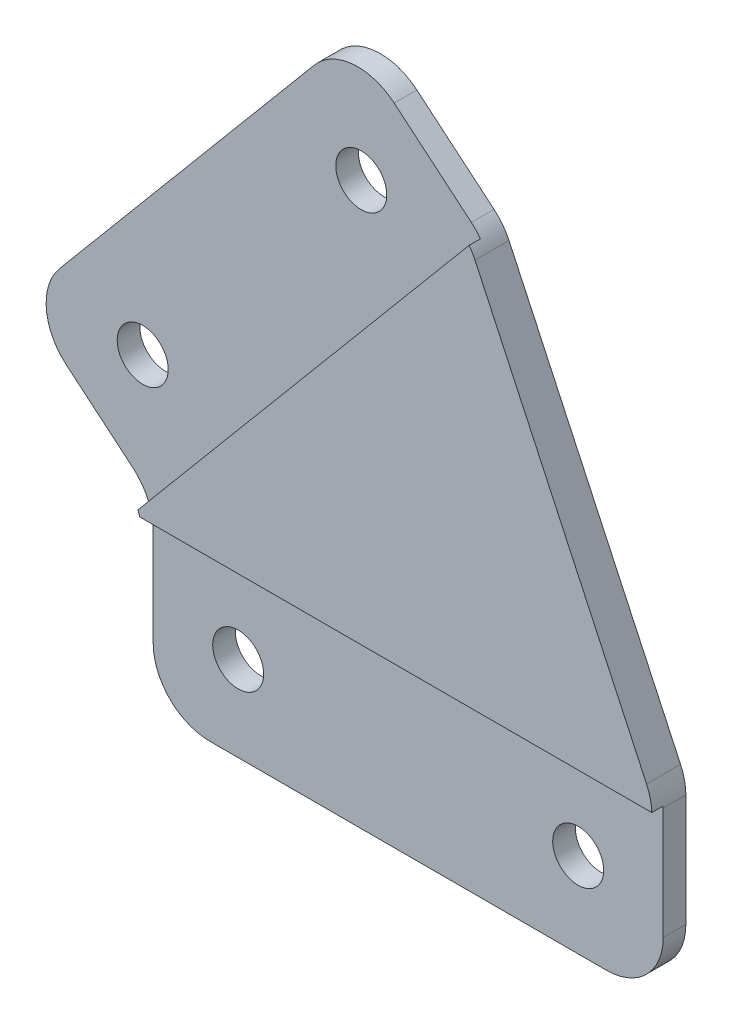
ISO-10303-21;
HEADER;
FILE_DESCRIPTION(('STEP AP214'),'2;1');
FILE_NAME('part.step','',(''),(''),'','','');
FILE_SCHEMA(('AUTOMOTIVE_DESIGN { 1 0 10303 214 1 1 1 1 }'));
ENDSEC;
DATA;
#1=APPLICATION_CONTEXT('core data for automotive mechanical design processes');
#2=APPLICATION_PROTOCOL_DEFINITION('international standard','automotive_design',2000,#1);
#3=PRODUCT_CONTEXT('',#1,'mechanical');
#4=PRODUCT('Part','Part','',(#3));
#5=PRODUCT_RELATED_PRODUCT_CATEGORY('part','',(#4));
#6=PRODUCT_DEFINITION_FORMATION('','',#4);
#7=PRODUCT_DEFINITION_CONTEXT('part definition',#1,'design');
#8=PRODUCT_DEFINITION('design','',#6,#7);
#9=PRODUCT_DEFINITION_SHAPE('','',#8);
#10=(LENGTH_UNIT() NAMED_UNIT(*) SI_UNIT(.MILLI.,.METRE.));
#11=(NAMED_UNIT(*) PLANE_ANGLE_UNIT() SI_UNIT($,.RADIAN.));
#12=(NAMED_UNIT(*) SI_UNIT($,.STERADIAN.) SOLID_ANGLE_UNIT());
#13=UNCERTAINTY_MEASURE_WITH_UNIT(LENGTH_MEASURE(1.E-05),#10,'distance_accuracy_value','');
#14=(GEOMETRIC_REPRESENTATION_CONTEXT(3) GLOBAL_UNCERTAINTY_ASSIGNED_CONTEXT((#13)) GLOBAL_UNIT_ASSIGNED_CONTEXT((#10,
#11,#12)) REPRESENTATION_CONTEXT('',''));
#15=CARTESIAN_POINT('',(0.,0.,0.));
#16=DIRECTION('',(0.,0.,1.));
#17=DIRECTION('',(1.,0.,0.));
#18=AXIS2_PLACEMENT_3D('',#15,#16,#17);
#19=CARTESIAN_POINT('',(-11.4906666467846,9.64181414529815,3.));
#20=DIRECTION('',(0.766044443118975,-0.642787609686543,0.));
#21=DIRECTION('',(0.642787609686543,0.766044443118975,0.));
#22=AXIS2_PLACEMENT_3D('',#19,#20,#21);
#23=PLANE('',#22);
#24=DIRECTION('',(0.,0.,-1.));
#25=VECTOR('',#24,1.);
#26=CARTESIAN_POINT('',(-8.27672859835191,13.472036360893,3.));
#27=LINE('',#26,#25);
#28=CARTESIAN_POINT('',(-8.27672859835191,13.472036360893,0.));
#29=VERTEX_POINT('',#28);
#30=CARTESIAN_POINT('',(-8.27672859835191,13.472036360893,2.));
#31=VERTEX_POINT('',#30);
#32=EDGE_CURVE('E193',#29,#31,#27,.F.);
#33=ORIENTED_EDGE('',*,*,#32,.T.);
#34=DIRECTION('',(-0.642787609686543,-0.766044443118975,0.));
#35=VECTOR('',#34,1.);
#36=CARTESIAN_POINT('',(17.4347757891098,44.113814085652,2.));
#37=LINE('',#36,#35);
#38=CARTESIAN_POINT('',(14.2208377406771,40.2835918700571,2.));
#39=VERTEX_POINT('',#38);
#40=EDGE_CURVE('E315',#39,#31,#37,.T.);
#41=ORIENTED_EDGE('',*,*,#40,.F.);
#42=DIRECTION('',(0.,0.,-1.));
#43=VECTOR('',#42,1.);
#44=CARTESIAN_POINT('',(14.2208377406771,40.2835918700571,3.));
#45=LINE('',#44,#43);
#46=CARTESIAN_POINT('',(14.2208377406771,40.2835918700571,0.));
#47=VERTEX_POINT('',#46);
#48=EDGE_CURVE('E310',#39,#47,#45,.T.);
#49=ORIENTED_EDGE('',*,*,#48,.T.);
#50=DIRECTION('',(-0.642787609686543,-0.766044443118975,0.));
#51=VECTOR('',#50,1.);
#52=CARTESIAN_POINT('',(-11.4906666467846,9.64181414529815,0.));
#53=LINE('',#52,#51);
#54=EDGE_CURVE('E246',#47,#29,#53,.T.);
#55=ORIENTED_EDGE('',*,*,#54,.T.);
#56=EDGE_LOOP('',(#33,#41,#49,#55));
#57=FACE_BOUND('',#56,.T.);
#58=ADVANCED_FACE('F41',(#57),#23,.F.);
#59=CARTESIAN_POINT('',(0.,0.,3.));
#60=DIRECTION('',(0.642787609686543,0.766044443118975,0.));
#61=DIRECTION('',(-0.766044443118975,0.642787609686543,0.));
#62=AXIS2_PLACEMENT_3D('',#59,#60,#61);
#63=PLANE('',#62);
#64=DIRECTION('',(0.,0.,-1.));
#65=VECTOR('',#64,1.);
#66=CARTESIAN_POINT('',(-1.78606195156728,1.4986839248199,3.));
#67=LINE('',#66,#65);
#68=CARTESIAN_POINT('',(-1.78606195156729,1.4986839248199,0.));
#69=VERTEX_POINT('',#68);
#70=CARTESIAN_POINT('',(-1.78606195156729,1.4986839248199,2.));
#71=VERTEX_POINT('',#70);
#72=EDGE_CURVE('E307',#69,#71,#67,.F.);
#73=ORIENTED_EDGE('',*,*,#72,.T.);
#74=DIRECTION('',(-0.766044443118975,0.642787609686543,0.));
#75=VECTOR('',#74,1.);
#76=CARTESIAN_POINT('',(0.,0.,2.));
#77=LINE('',#76,#75);
#78=CARTESIAN_POINT('',(-7.66044443118975,6.42787609686543,2.));
#79=VERTEX_POINT('',#78);
#80=EDGE_CURVE('E326',#71,#79,#77,.T.);
#81=ORIENTED_EDGE('',*,*,#80,.T.);
#82=DIRECTION('',(0.,0.,-1.));
#83=VECTOR('',#82,1.);
#84=CARTESIAN_POINT('',(-7.66044443118975,6.42787609686543,3.));
#85=LINE('',#84,#83);
#86=CARTESIAN_POINT('',(-7.66044443118975,6.42787609686543,0.));
#87=VERTEX_POINT('',#86);
#88=EDGE_CURVE('E305',#79,#87,#85,.T.);
#89=ORIENTED_EDGE('',*,*,#88,.T.);
#90=DIRECTION('',(0.766044443118975,-0.642787609686543,0.));
#91=VECTOR('',#90,1.);
#92=CARTESIAN_POINT('',(0.,0.,0.));
#93=LINE('',#92,#91);
#94=EDGE_CURVE('E253',#87,#69,#93,.T.);
#95=ORIENTED_EDGE('',*,*,#94,.T.);
#96=EDGE_LOOP('',(#73,#81,#89,#95));
#97=FACE_BOUND('',#96,.T.);
#98=ADVANCED_FACE('F412',(#97),#63,.F.);
#99=CARTESIAN_POINT('',(0.,0.,3.));
#100=DIRECTION('',(1.,0.,0.));
#101=DIRECTION('',(0.,1.,0.));
#102=AXIS2_PLACEMENT_3D('',#99,#100,#101);
#103=PLANE('',#102);
#104=DIRECTION('',(0.,0.,-1.));
#105=VECTOR('',#104,1.);
#106=CARTESIAN_POINT('',(0.,-11.,3.));
#107=LINE('',#106,#105);
#108=CARTESIAN_POINT('',(0.,-11.,0.));
#109=VERTEX_POINT('',#108);
#110=CARTESIAN_POINT('',(0.,-11.,2.));
#111=VERTEX_POINT('',#110);
#112=EDGE_CURVE('E210',#109,#111,#107,.F.);
#113=ORIENTED_EDGE('',*,*,#112,.T.);
#114=DIRECTION('',(0.,1.,0.));
#115=VECTOR('',#114,1.);
#116=CARTESIAN_POINT('',(0.,0.,2.));
#117=LINE('',#116,#115);
#118=CARTESIAN_POINT('',(0.,-2.33153829077498,2.));
#119=VERTEX_POINT('',#118);
#120=EDGE_CURVE('E203',#111,#119,#117,.T.);
#121=ORIENTED_EDGE('',*,*,#120,.T.);
#122=DIRECTION('',(0.,0.,-1.));
#123=VECTOR('',#122,1.);
#124=CARTESIAN_POINT('',(0.,-2.33153829077498,0.));
#125=LINE('',#124,#123);
#126=CARTESIAN_POINT('',(0.,-2.33153829077498,0.));
#127=VERTEX_POINT('',#126);
#128=EDGE_CURVE('E199',#119,#127,#125,.T.);
#129=ORIENTED_EDGE('',*,*,#128,.T.);
#130=DIRECTION('',(0.,-1.,0.));
#131=VECTOR('',#130,1.);
#132=CARTESIAN_POINT('',(0.,0.,0.));
#133=LINE('',#132,#131);
#134=EDGE_CURVE('E256',#127,#109,#133,.T.);
#135=ORIENTED_EDGE('',*,*,#134,.T.);
#136=EDGE_LOOP('',(#113,#121,#129,#135));
#137=FACE_BOUND('',#136,.T.);
#138=ADVANCED_FACE('F207',(#137),#103,.F.);
#139=CARTESIAN_POINT('',(0.,-16.,3.));
#140=DIRECTION('',(0.,1.,0.));
#141=DIRECTION('',(0.,0.,1.));
#142=AXIS2_PLACEMENT_3D('',#139,#140,#141);
#143=PLANE('',#142);
#144=DIRECTION('',(0.,0.,-1.));
#145=VECTOR('',#144,1.);
#146=CARTESIAN_POINT('',(40.,-16.,3.));
#147=LINE('',#146,#145);
#148=CARTESIAN_POINT('',(40.,-16.,0.));
#149=VERTEX_POINT('',#148);
#150=CARTESIAN_POINT('',(40.,-16.,2.));
#151=VERTEX_POINT('',#150);
#152=EDGE_CURVE('E300',#149,#151,#147,.F.);
#153=ORIENTED_EDGE('',*,*,#152,.T.);
#154=DIRECTION('',(1.,0.,0.));
#155=VECTOR('',#154,1.);
#156=CARTESIAN_POINT('',(-1.,-16.,2.));
#157=LINE('',#156,#155);
#158=CARTESIAN_POINT('',(5.,-16.,2.));
#159=VERTEX_POINT('',#158);
#160=EDGE_CURVE('E332',#159,#151,#157,.T.);
#161=ORIENTED_EDGE('',*,*,#160,.F.);
#162=DIRECTION('',(0.,0.,-1.));
#163=VECTOR('',#162,1.);
#164=CARTESIAN_POINT('',(5.,-16.,3.));
#165=LINE('',#164,#163);
#166=CARTESIAN_POINT('',(5.,-16.,0.));
#167=VERTEX_POINT('',#166);
#168=EDGE_CURVE('E298',#159,#167,#165,.T.);
#169=ORIENTED_EDGE('',*,*,#168,.T.);
#170=DIRECTION('',(1.,0.,0.));
#171=VECTOR('',#170,1.);
#172=CARTESIAN_POINT('',(0.,-16.,0.));
#173=LINE('',#172,#171);
#174=EDGE_CURVE('E258',#167,#149,#173,.T.);
#175=ORIENTED_EDGE('',*,*,#174,.T.);
#176=EDGE_LOOP('',(#153,#161,#169,#175));
#177=FACE_BOUND('',#176,.T.);
#178=ADVANCED_FACE('F390',(#177),#143,.F.);
#179=CARTESIAN_POINT('',(45.,0.,3.));
#180=DIRECTION('',(-1.,0.,0.));
#181=DIRECTION('',(0.,0.,1.));
#182=AXIS2_PLACEMENT_3D('',#179,#180,#181);
#183=PLANE('',#182);
#184=DIRECTION('',(0.,0.,-1.));
#185=VECTOR('',#184,1.);
#186=CARTESIAN_POINT('',(45.,-1.10847331321474,3.));
#187=LINE('',#186,#185);
#188=CARTESIAN_POINT('',(45.,-1.10847331321474,0.));
#189=VERTEX_POINT('',#188);
#190=CARTESIAN_POINT('',(45.,-1.10847331321474,2.));
#191=VERTEX_POINT('',#190);
#192=EDGE_CURVE('E295',#189,#191,#187,.F.);
#193=ORIENTED_EDGE('',*,*,#192,.T.);
#194=DIRECTION('',(0.,1.,0.));
#195=VECTOR('',#194,1.);
#196=CARTESIAN_POINT('',(45.,-16.,2.));
#197=LINE('',#196,#195);
#198=CARTESIAN_POINT('',(45.,-11.,2.));
#199=VERTEX_POINT('',#198);
#200=EDGE_CURVE('E378',#199,#191,#197,.T.);
#201=ORIENTED_EDGE('',*,*,#200,.F.);
#202=DIRECTION('',(0.,0.,-1.));
#203=VECTOR('',#202,1.);
#204=CARTESIAN_POINT('',(45.,-11.,3.));
#205=LINE('',#204,#203);
#206=CARTESIAN_POINT('',(45.,-11.,0.));
#207=VERTEX_POINT('',#206);
#208=EDGE_CURVE('E293',#199,#207,#205,.T.);
#209=ORIENTED_EDGE('',*,*,#208,.T.);
#210=DIRECTION('',(0.,1.,0.));
#211=VECTOR('',#210,1.);
#212=CARTESIAN_POINT('',(45.,0.,0.));
#213=LINE('',#212,#211);
#214=EDGE_CURVE('E261',#207,#189,#213,.T.);
#215=ORIENTED_EDGE('',*,*,#214,.T.);
#216=EDGE_LOOP('',(#193,#201,#209,#215));
#217=FACE_BOUND('',#216,.T.);
#218=ADVANCED_FACE('F397',(#217),#183,.F.);
#219=CARTESIAN_POINT('',(36.9627212179472,17.2359999701769,3.));
#220=DIRECTION('',(-0.906307787036651,-0.422618261740697,0.));
#221=DIRECTION('',(0.422618261740697,-0.906307787036651,0.));
#222=AXIS2_PLACEMENT_3D('',#219,#220,#221);
#223=PLANE('',#222);
#224=DIRECTION('',(-0.422618261740697,0.906307787036651,0.));
#225=VECTOR('',#224,1.);
#226=CARTESIAN_POINT('',(36.9627212179472,17.2359999701769,0.));
#227=LINE('',#226,#225);
#228=CARTESIAN_POINT('',(44.5315389351833,1.00461799548874,0.));
#229=VERTEX_POINT('',#228);
#230=CARTESIAN_POINT('',(29.3939035007112,33.4673819448651,0.));
#231=VERTEX_POINT('',#230);
#232=EDGE_CURVE('E264',#229,#231,#227,.T.);
#233=ORIENTED_EDGE('',*,*,#232,.T.);
#234=DIRECTION('',(0.,0.,-1.));
#235=VECTOR('',#234,1.);
#236=CARTESIAN_POINT('',(29.3939035007112,33.4673819448651,3.));
#237=LINE('',#236,#235);
#238=CARTESIAN_POINT('',(29.3939035007112,33.4673819448651,3.));
#239=VERTEX_POINT('',#238);
#240=EDGE_CURVE('E288',#231,#239,#237,.F.);
#241=ORIENTED_EDGE('',*,*,#240,.T.);
#242=DIRECTION('',(-0.422618261740697,0.906307787036651,0.));
#243=VECTOR('',#242,1.);
#244=CARTESIAN_POINT('',(36.9627212179472,17.2359999701769,3.));
#245=LINE('',#244,#243);
#246=CARTESIAN_POINT('',(44.5315389351833,1.00461799548874,3.));
#247=VERTEX_POINT('',#246);
#248=EDGE_CURVE('E247',#247,#239,#245,.T.);
#249=ORIENTED_EDGE('',*,*,#248,.F.);
#250=DIRECTION('',(0.,0.,-1.));
#251=VECTOR('',#250,1.);
#252=CARTESIAN_POINT('',(44.5315389351833,1.00461799548874,3.));
#253=LINE('',#252,#251);
#254=EDGE_CURVE('E285',#247,#229,#253,.T.);
#255=ORIENTED_EDGE('',*,*,#254,.T.);
#256=EDGE_LOOP('',(#233,#241,#249,#255));
#257=FACE_BOUND('',#256,.T.);
#258=ADVANCED_FACE('F406',(#257),#223,.F.);
#259=CARTESIAN_POINT('',(28.9254424358945,34.4719999403539,3.));
#260=DIRECTION('',(-0.642787609686543,-0.766044443118974,0.));
#261=DIRECTION('',(0.766044443118975,-0.642787609686544,0.));
#262=AXIS2_PLACEMENT_3D('',#259,#260,#261);
#263=PLANE('',#262);
#264=DIRECTION('',(0.,0.,-1.));
#265=VECTOR('',#264,1.);
#266=CARTESIAN_POINT('',(21.2649980047047,40.8998760372193,3.));
#267=LINE('',#266,#265);
#268=CARTESIAN_POINT('',(21.2649980047047,40.8998760372193,0.));
#269=VERTEX_POINT('',#268);
#270=CARTESIAN_POINT('',(21.2649980047047,40.8998760372193,2.));
#271=VERTEX_POINT('',#270);
#272=EDGE_CURVE('E249',#269,#271,#267,.F.);
#273=ORIENTED_EDGE('',*,*,#272,.T.);
#274=DIRECTION('',(-0.766044443118975,0.642787609686543,0.));
#275=VECTOR('',#274,1.);
#276=CARTESIAN_POINT('',(17.4347757891098,44.113814085652,2.));
#277=LINE('',#276,#275);
#278=CARTESIAN_POINT('',(28.0763026139606,35.1845128517565,2.));
#279=VERTEX_POINT('',#278);
#280=EDGE_CURVE('E64',#279,#271,#277,.T.);
#281=ORIENTED_EDGE('',*,*,#280,.F.);
#282=DIRECTION('',(0.,0.,-1.));
#283=VECTOR('',#282,1.);
#284=CARTESIAN_POINT('',(28.0763026139607,35.1845128517565,3.));
#285=LINE('',#284,#283);
#286=CARTESIAN_POINT('',(28.0763026139607,35.1845128517565,0.));
#287=VERTEX_POINT('',#286);
#288=EDGE_CURVE('E271',#279,#287,#285,.T.);
#289=ORIENTED_EDGE('',*,*,#288,.T.);
#290=DIRECTION('',(-0.766044443118975,0.642787609686543,0.));
#291=VECTOR('',#290,1.);
#292=CARTESIAN_POINT('',(28.9254424358945,34.4719999403539,0.));
#293=LINE('',#292,#291);
#294=EDGE_CURVE('E250',#287,#269,#293,.T.);
#295=ORIENTED_EDGE('',*,*,#294,.T.);
#296=EDGE_LOOP('',(#273,#281,#289,#295));
#297=FACE_BOUND('',#296,.T.);
#298=ADVANCED_FACE('F371',(#297),#263,.F.);
#299=CARTESIAN_POINT('',(0.,0.,3.));
#300=DIRECTION('',(0.,0.,1.));
#301=DIRECTION('',(1.,0.,0.));
#302=AXIS2_PLACEMENT_3D('',#299,#300,#301);
#303=PLANE('',#302);
#304=DIRECTION('',(0.642787609686543,0.766044443118975,0.));
#305=VECTOR('',#304,1.);
#306=CARTESIAN_POINT('',(28.9637446580504,34.4398605598695,3.));
#307=LINE('',#306,#305);
#308=CARTESIAN_POINT('',(-0.349688589136452,-0.494528823735607,3.));
#309=VERTEX_POINT('',#308);
#310=CARTESIAN_POINT('',(28.8762887770626,34.3356346995088,3.));
#311=VERTEX_POINT('',#310);
#312=EDGE_CURVE('E167',#309,#311,#307,.T.);
#313=ORIENTED_EDGE('',*,*,#312,.F.);
#314=CARTESIAN_POINT('',(-5.,-2.33153829077498,3.));
#315=DIRECTION('',(0.,0.,1.));
#316=DIRECTION('',(1.,0.,0.));
#317=AXIS2_PLACEMENT_3D('',#314,#315,#316);
#318=CIRCLE('',#317,5.);
#319=CARTESIAN_POINT('',(-0.19465381568377,-0.950000000000002,3.));
#320=VERTEX_POINT('',#319);
#321=EDGE_CURVE('E179',#309,#320,#318,.F.);
#322=ORIENTED_EDGE('',*,*,#321,.T.);
#323=DIRECTION('',(-1.,0.,0.));
#324=VECTOR('',#323,1.);
#325=CARTESIAN_POINT('',(-1.,-0.950000000000002,3.));
#326=LINE('',#325,#324);
#327=CARTESIAN_POINT('',(44.9974879898804,-0.95,3.));
#328=VERTEX_POINT('',#327);
#329=EDGE_CURVE('E183',#328,#320,#326,.T.);
#330=ORIENTED_EDGE('',*,*,#329,.F.);
#331=CARTESIAN_POINT('',(40.,-1.10847331321474,3.));
#332=DIRECTION('',(0.,0.,1.));
#333=DIRECTION('',(1.,0.,0.));
#334=AXIS2_PLACEMENT_3D('',#331,#332,#333);
#335=CIRCLE('',#334,5.);
#336=EDGE_CURVE('E290',#328,#247,#335,.T.);
#337=ORIENTED_EDGE('',*,*,#336,.T.);
#338=ORIENTED_EDGE('',*,*,#248,.T.);
#339=CARTESIAN_POINT('',(24.8623645655279,31.3542906361616,3.));
#340=DIRECTION('',(0.,0.,1.));
#341=DIRECTION('',(1.,0.,0.));
#342=AXIS2_PLACEMENT_3D('',#339,#340,#341);
#343=CIRCLE('',#342,5.);
#344=EDGE_CURVE('E182',#239,#311,#343,.T.);
#345=ORIENTED_EDGE('',*,*,#344,.T.);
#346=EDGE_LOOP('',(#313,#322,#330,#337,#338,#345));
#347=FACE_BOUND('',#346,.T.);
#348=ADVANCED_FACE('F177',(#347),#303,.T.);
#349=CARTESIAN_POINT('',(0.,0.,0.));
#350=DIRECTION('',(0.,0.,1.));
#351=DIRECTION('',(1.,0.,0.));
#352=AXIS2_PLACEMENT_3D('',#349,#350,#351);
#353=PLANE('',#352);
#354=CARTESIAN_POINT('',(37.5,-8.5,0.));
#355=DIRECTION('',(0.,0.,1.));
#356=DIRECTION('',(1.,0.,0.));
#357=AXIS2_PLACEMENT_3D('',#354,#355,#356);
#358=CIRCLE('',#357,2.25);
#359=CARTESIAN_POINT('',(39.75,-8.5,0.));
#360=VERTEX_POINT('',#359);
#361=EDGE_CURVE('E234',#360,#360,#358,.T.);
#362=ORIENTED_EDGE('',*,*,#361,.T.);
#363=EDGE_LOOP('',(#362));
#364=FACE_BOUND('',#363,.T.);
#365=CARTESIAN_POINT('',(18.3592020398531,33.5475736896106,0.));
#366=DIRECTION('',(0.,0.,1.));
#367=DIRECTION('',(1.,0.,0.));
#368=AXIS2_PLACEMENT_3D('',#365,#366,#367);
#369=CIRCLE('',#368,2.25);
#370=CARTESIAN_POINT('',(20.6092020398531,33.5475736896106,0.));
#371=VERTEX_POINT('',#370);
#372=EDGE_CURVE('E239',#371,#371,#369,.T.);
#373=ORIENTED_EDGE('',*,*,#372,.T.);
#374=EDGE_LOOP('',(#373));
#375=FACE_BOUND('',#374,.T.);
#376=CARTESIAN_POINT('',(-0.924426250743252,10.5662403960414,0.));
#377=DIRECTION('',(0.,0.,1.));
#378=DIRECTION('',(1.,0.,0.));
#379=AXIS2_PLACEMENT_3D('',#376,#377,#378);
#380=CIRCLE('',#379,2.25);
#381=CARTESIAN_POINT('',(1.32557374925675,10.5662403960414,0.));
#382=VERTEX_POINT('',#381);
#383=EDGE_CURVE('E235',#382,#382,#380,.T.);
#384=ORIENTED_EDGE('',*,*,#383,.T.);
#385=EDGE_LOOP('',(#384));
#386=FACE_BOUND('',#385,.T.);
#387=CARTESIAN_POINT('',(7.5,-8.5,0.));
#388=DIRECTION('',(0.,0.,1.));
#389=DIRECTION('',(1.,0.,0.));
#390=AXIS2_PLACEMENT_3D('',#387,#388,#389);
#391=CIRCLE('',#390,2.25);
#392=CARTESIAN_POINT('',(9.75,-8.5,0.));
#393=VERTEX_POINT('',#392);
#394=EDGE_CURVE('E238',#393,#393,#391,.T.);
#395=ORIENTED_EDGE('',*,*,#394,.T.);
#396=EDGE_LOOP('',(#395));
#397=FACE_BOUND('',#396,.T.);
#398=ORIENTED_EDGE('',*,*,#294,.F.);
#399=CARTESIAN_POINT('',(24.8623645655279,31.3542906361616,0.));
#400=DIRECTION('',(0.,0.,1.));
#401=DIRECTION('',(1.,0.,0.));
#402=AXIS2_PLACEMENT_3D('',#399,#400,#401);
#403=CIRCLE('',#402,5.);
#404=EDGE_CURVE('E283',#287,#231,#403,.F.);
#405=ORIENTED_EDGE('',*,*,#404,.T.);
#406=ORIENTED_EDGE('',*,*,#232,.F.);
#407=CARTESIAN_POINT('',(40.,-1.10847331321474,0.));
#408=DIRECTION('',(0.,0.,1.));
#409=DIRECTION('',(1.,0.,0.));
#410=AXIS2_PLACEMENT_3D('',#407,#408,#409);
#411=CIRCLE('',#410,5.);
#412=EDGE_CURVE('E281',#229,#189,#411,.F.);
#413=ORIENTED_EDGE('',*,*,#412,.T.);
#414=ORIENTED_EDGE('',*,*,#214,.F.);
#415=CARTESIAN_POINT('',(40.,-11.,0.));
#416=DIRECTION('',(0.,0.,1.));
#417=DIRECTION('',(1.,0.,0.));
#418=AXIS2_PLACEMENT_3D('',#415,#416,#417);
#419=CIRCLE('',#418,5.);
#420=EDGE_CURVE('E279',#207,#149,#419,.F.);
#421=ORIENTED_EDGE('',*,*,#420,.T.);
#422=ORIENTED_EDGE('',*,*,#174,.F.);
#423=CARTESIAN_POINT('',(5.,-11.,0.));
#424=DIRECTION('',(0.,0.,1.));
#425=DIRECTION('',(1.,0.,0.));
#426=AXIS2_PLACEMENT_3D('',#423,#424,#425);
#427=CIRCLE('',#426,5.);
#428=EDGE_CURVE('E277',#167,#109,#427,.F.);
#429=ORIENTED_EDGE('',*,*,#428,.T.);
#430=ORIENTED_EDGE('',*,*,#134,.F.);
#431=CARTESIAN_POINT('',(-5.,-2.33153829077498,0.));
#432=DIRECTION('',(0.,0.,1.));
#433=DIRECTION('',(1.,0.,0.));
#434=AXIS2_PLACEMENT_3D('',#431,#432,#433);
#435=CIRCLE('',#434,5.);
#436=EDGE_CURVE('E189',#127,#69,#435,.T.);
#437=ORIENTED_EDGE('',*,*,#436,.T.);
#438=ORIENTED_EDGE('',*,*,#94,.F.);
#439=CARTESIAN_POINT('',(-4.44650638275704,10.2580983124603,0.));
#440=DIRECTION('',(0.,0.,1.));
#441=DIRECTION('',(1.,0.,0.));
#442=AXIS2_PLACEMENT_3D('',#439,#440,#441);
#443=CIRCLE('',#442,5.);
#444=EDGE_CURVE('E275',#87,#29,#443,.F.);
#445=ORIENTED_EDGE('',*,*,#444,.T.);
#446=ORIENTED_EDGE('',*,*,#54,.F.);
#447=CARTESIAN_POINT('',(18.051059956272,37.0696538216244,0.));
#448=DIRECTION('',(0.,0.,1.));
#449=DIRECTION('',(1.,0.,0.));
#450=AXIS2_PLACEMENT_3D('',#447,#448,#449);
#451=CIRCLE('',#450,5.);
#452=EDGE_CURVE('E273',#47,#269,#451,.F.);
#453=ORIENTED_EDGE('',*,*,#452,.T.);
#454=EDGE_LOOP('',(#398,#405,#406,#413,#414,#421,#422,#429,#430,#437,#438,#445,#446,#453));
#455=FACE_BOUND('',#454,.T.);
#456=ADVANCED_FACE('F358',(#364,#375,#386,#397,#455),#353,.F.);
#457=CARTESIAN_POINT('',(7.5,-8.5,0.));
#458=DIRECTION('',(0.,0.,1.));
#459=DIRECTION('',(1.,0.,0.));
#460=AXIS2_PLACEMENT_3D('',#457,#458,#459);
#461=CYLINDRICAL_SURFACE('',#460,2.25);
#462=CARTESIAN_POINT('',(7.5,-8.5,2.));
#463=DIRECTION('',(0.,0.,-1.));
#464=DIRECTION('',(-1.,0.,0.));
#465=AXIS2_PLACEMENT_3D('',#462,#463,#464);
#466=CIRCLE('',#465,2.25);
#467=CARTESIAN_POINT('',(5.25,-8.5,2.));
#468=VERTEX_POINT('',#467);
#469=EDGE_CURVE('E227',#468,#468,#466,.F.);
#470=ORIENTED_EDGE('',*,*,#469,.T.);
#471=EDGE_LOOP('',(#470));
#472=FACE_BOUND('',#471,.T.);
#473=ORIENTED_EDGE('',*,*,#394,.F.);
#474=EDGE_LOOP('',(#473));
#475=FACE_BOUND('',#474,.T.);
#476=ADVANCED_FACE('F354',(#472,#475),#461,.F.);
#477=CARTESIAN_POINT('',(-0.924426250743252,10.5662403960414,0.));
#478=DIRECTION('',(0.,0.,1.));
#479=DIRECTION('',(1.,0.,0.));
#480=AXIS2_PLACEMENT_3D('',#477,#478,#479);
#481=CYLINDRICAL_SURFACE('',#480,2.25);
#482=CARTESIAN_POINT('',(-0.924426250743252,10.5662403960414,2.));
#483=DIRECTION('',(0.,0.,-1.));
#484=DIRECTION('',(-1.,0.,0.));
#485=AXIS2_PLACEMENT_3D('',#482,#483,#484);
#486=CIRCLE('',#485,2.25);
#487=CARTESIAN_POINT('',(-3.17442625074325,10.5662403960414,2.));
#488=VERTEX_POINT('',#487);
#489=EDGE_CURVE('E212',#488,#488,#486,.F.);
#490=ORIENTED_EDGE('',*,*,#489,.T.);
#491=EDGE_LOOP('',(#490));
#492=FACE_BOUND('',#491,.T.);
#493=ORIENTED_EDGE('',*,*,#383,.F.);
#494=EDGE_LOOP('',(#493));
#495=FACE_BOUND('',#494,.T.);
#496=ADVANCED_FACE('F351',(#492,#495),#481,.F.);
#497=CARTESIAN_POINT('',(18.3592020398531,33.5475736896106,0.));
#498=DIRECTION('',(0.,0.,1.));
#499=DIRECTION('',(1.,0.,0.));
#500=AXIS2_PLACEMENT_3D('',#497,#498,#499);
#501=CYLINDRICAL_SURFACE('',#500,2.25);
#502=CARTESIAN_POINT('',(18.3592020398531,33.5475736896106,2.));
#503=DIRECTION('',(0.,0.,-1.));
#504=DIRECTION('',(-1.,0.,0.));
#505=AXIS2_PLACEMENT_3D('',#502,#503,#504);
#506=CIRCLE('',#505,2.25);
#507=CARTESIAN_POINT('',(16.1092020398531,33.5475736896106,2.));
#508=VERTEX_POINT('',#507);
#509=EDGE_CURVE('E217',#508,#508,#506,.F.);
#510=ORIENTED_EDGE('',*,*,#509,.T.);
#511=EDGE_LOOP('',(#510));
#512=FACE_BOUND('',#511,.T.);
#513=ORIENTED_EDGE('',*,*,#372,.F.);
#514=EDGE_LOOP('',(#513));
#515=FACE_BOUND('',#514,.T.);
#516=ADVANCED_FACE('F340',(#512,#515),#501,.F.);
#517=CARTESIAN_POINT('',(37.5,-8.5,0.));
#518=DIRECTION('',(0.,0.,1.));
#519=DIRECTION('',(1.,0.,0.));
#520=AXIS2_PLACEMENT_3D('',#517,#518,#519);
#521=CYLINDRICAL_SURFACE('',#520,2.25);
#522=CARTESIAN_POINT('',(37.5,-8.5,2.));
#523=DIRECTION('',(0.,0.,-1.));
#524=DIRECTION('',(-1.,0.,0.));
#525=AXIS2_PLACEMENT_3D('',#522,#523,#524);
#526=CIRCLE('',#525,2.25);
#527=CARTESIAN_POINT('',(35.25,-8.5,2.));
#528=VERTEX_POINT('',#527);
#529=EDGE_CURVE('E224',#528,#528,#526,.F.);
#530=ORIENTED_EDGE('',*,*,#529,.T.);
#531=EDGE_LOOP('',(#530));
#532=FACE_BOUND('',#531,.T.);
#533=ORIENTED_EDGE('',*,*,#361,.F.);
#534=EDGE_LOOP('',(#533));
#535=FACE_BOUND('',#534,.T.);
#536=ADVANCED_FACE('F433',(#532,#535),#521,.F.);
#537=CARTESIAN_POINT('',(24.8623645655279,31.3542906361616,3.));
#538=DIRECTION('',(0.,0.,-1.));
#539=DIRECTION('',(-1.,0.,0.));
#540=AXIS2_PLACEMENT_3D('',#537,#538,#539);
#541=CYLINDRICAL_SURFACE('',#540,5.);
#542=DIRECTION('',(0.,0.,-1.));
#543=VECTOR('',#542,1.);
#544=CARTESIAN_POINT('',(28.8762887770626,34.3356346995088,3.));
#545=LINE('',#544,#543);
#546=CARTESIAN_POINT('',(28.8762887770626,34.3356346995088,2.));
#547=VERTEX_POINT('',#546);
#548=EDGE_CURVE('E232',#311,#547,#545,.T.);
#549=ORIENTED_EDGE('',*,*,#548,.F.);
#550=ORIENTED_EDGE('',*,*,#344,.F.);
#551=ORIENTED_EDGE('',*,*,#240,.F.);
#552=ORIENTED_EDGE('',*,*,#404,.F.);
#553=ORIENTED_EDGE('',*,*,#288,.F.);
#554=CARTESIAN_POINT('',(24.8623645655279,31.3542906361616,2.));
#555=DIRECTION('',(0.,0.,-1.));
#556=DIRECTION('',(-1.,0.,0.));
#557=AXIS2_PLACEMENT_3D('',#554,#555,#556);
#558=CIRCLE('',#557,5.);
#559=EDGE_CURVE('E336',#547,#279,#558,.F.);
#560=ORIENTED_EDGE('',*,*,#559,.F.);
#561=EDGE_LOOP('',(#549,#550,#551,#552,#553,#560));
#562=FACE_BOUND('',#561,.T.);
#563=ADVANCED_FACE('F409',(#562),#541,.T.);
#564=CARTESIAN_POINT('',(40.,-1.10847331321474,3.));
#565=DIRECTION('',(0.,0.,-1.));
#566=DIRECTION('',(-1.,0.,0.));
#567=AXIS2_PLACEMENT_3D('',#564,#565,#566);
#568=CYLINDRICAL_SURFACE('',#567,5.);
#569=DIRECTION('',(0.,0.,-1.));
#570=VECTOR('',#569,1.);
#571=CARTESIAN_POINT('',(44.9974879898804,-0.95,3.));
#572=LINE('',#571,#570);
#573=CARTESIAN_POINT('',(44.9974879898804,-0.95,2.));
#574=VERTEX_POINT('',#573);
#575=EDGE_CURVE('E230',#574,#328,#572,.F.);
#576=ORIENTED_EDGE('',*,*,#575,.F.);
#577=CARTESIAN_POINT('',(40.,-1.10847331321474,2.));
#578=DIRECTION('',(0.,0.,-1.));
#579=DIRECTION('',(-1.,0.,0.));
#580=AXIS2_PLACEMENT_3D('',#577,#578,#579);
#581=CIRCLE('',#580,5.);
#582=EDGE_CURVE('E222',#191,#574,#581,.F.);
#583=ORIENTED_EDGE('',*,*,#582,.F.);
#584=ORIENTED_EDGE('',*,*,#192,.F.);
#585=ORIENTED_EDGE('',*,*,#412,.F.);
#586=ORIENTED_EDGE('',*,*,#254,.F.);
#587=ORIENTED_EDGE('',*,*,#336,.F.);
#588=EDGE_LOOP('',(#576,#583,#584,#585,#586,#587));
#589=FACE_BOUND('',#588,.T.);
#590=ADVANCED_FACE('F400',(#589),#568,.T.);
#591=CARTESIAN_POINT('',(40.,-11.,3.));
#592=DIRECTION('',(0.,0.,-1.));
#593=DIRECTION('',(-1.,0.,0.));
#594=AXIS2_PLACEMENT_3D('',#591,#592,#593);
#595=CYLINDRICAL_SURFACE('',#594,5.);
#596=CARTESIAN_POINT('',(40.,-11.,2.));
#597=DIRECTION('',(0.,0.,-1.));
#598=DIRECTION('',(-1.,0.,0.));
#599=AXIS2_PLACEMENT_3D('',#596,#597,#598);
#600=CIRCLE('',#599,5.);
#601=EDGE_CURVE('E214',#151,#199,#600,.F.);
#602=ORIENTED_EDGE('',*,*,#601,.F.);
#603=ORIENTED_EDGE('',*,*,#152,.F.);
#604=ORIENTED_EDGE('',*,*,#420,.F.);
#605=ORIENTED_EDGE('',*,*,#208,.F.);
#606=EDGE_LOOP('',(#602,#603,#604,#605));
#607=FACE_BOUND('',#606,.T.);
#608=ADVANCED_FACE('F388',(#607),#595,.T.);
#609=CARTESIAN_POINT('',(5.,-11.,3.));
#610=DIRECTION('',(0.,0.,-1.));
#611=DIRECTION('',(-1.,0.,0.));
#612=AXIS2_PLACEMENT_3D('',#609,#610,#611);
#613=CYLINDRICAL_SURFACE('',#612,5.);
#614=CARTESIAN_POINT('',(5.,-11.,2.));
#615=DIRECTION('',(0.,0.,-1.));
#616=DIRECTION('',(-1.,0.,0.));
#617=AXIS2_PLACEMENT_3D('',#614,#615,#616);
#618=CIRCLE('',#617,5.);
#619=EDGE_CURVE('E211',#111,#159,#618,.F.);
#620=ORIENTED_EDGE('',*,*,#619,.F.);
#621=ORIENTED_EDGE('',*,*,#112,.F.);
#622=ORIENTED_EDGE('',*,*,#428,.F.);
#623=ORIENTED_EDGE('',*,*,#168,.F.);
#624=EDGE_LOOP('',(#620,#621,#622,#623));
#625=FACE_BOUND('',#624,.T.);
#626=ADVANCED_FACE('F414',(#625),#613,.T.);
#627=CARTESIAN_POINT('',(-5.,-2.33153829077498,3.));
#628=DIRECTION('',(0.,0.,1.));
#629=DIRECTION('',(1.,0.,0.));
#630=AXIS2_PLACEMENT_3D('',#627,#628,#629);
#631=CYLINDRICAL_SURFACE('',#630,5.);
#632=ORIENTED_EDGE('',*,*,#321,.F.);
#633=DIRECTION('',(0.,0.,1.));
#634=VECTOR('',#633,1.);
#635=CARTESIAN_POINT('',(-0.349688589136452,-0.494528823735607,3.));
#636=LINE('',#635,#634);
#637=CARTESIAN_POINT('',(-0.349688589136452,-0.494528823735607,2.));
#638=VERTEX_POINT('',#637);
#639=EDGE_CURVE('E11',#309,#638,#636,.F.);
#640=ORIENTED_EDGE('',*,*,#639,.T.);
#641=CARTESIAN_POINT('',(-5.,-2.33153829077498,2.));
#642=DIRECTION('',(0.,0.,-1.));
#643=DIRECTION('',(-1.,0.,0.));
#644=AXIS2_PLACEMENT_3D('',#641,#642,#643);
#645=CIRCLE('',#644,5.);
#646=EDGE_CURVE('E328',#638,#71,#645,.F.);
#647=ORIENTED_EDGE('',*,*,#646,.T.);
#648=ORIENTED_EDGE('',*,*,#72,.F.);
#649=ORIENTED_EDGE('',*,*,#436,.F.);
#650=ORIENTED_EDGE('',*,*,#128,.F.);
#651=CARTESIAN_POINT('',(-5.,-2.33153829077498,2.));
#652=DIRECTION('',(0.,0.,-1.));
#653=DIRECTION('',(-1.,0.,0.));
#654=AXIS2_PLACEMENT_3D('',#651,#652,#653);
#655=CIRCLE('',#654,5.);
#656=CARTESIAN_POINT('',(-0.19465381568377,-0.950000000000002,2.));
#657=VERTEX_POINT('',#656);
#658=EDGE_CURVE('E191',#119,#657,#655,.F.);
#659=ORIENTED_EDGE('',*,*,#658,.T.);
#660=DIRECTION('',(0.,0.,1.));
#661=VECTOR('',#660,1.);
#662=CARTESIAN_POINT('',(-0.19465381568377,-0.950000000000002,3.));
#663=LINE('',#662,#661);
#664=EDGE_CURVE('E49',#657,#320,#663,.T.);
#665=ORIENTED_EDGE('',*,*,#664,.T.);
#666=EDGE_LOOP('',(#632,#640,#647,#648,#649,#650,#659,#665));
#667=FACE_BOUND('',#666,.T.);
#668=ADVANCED_FACE('F186',(#667),#631,.F.);
#669=CARTESIAN_POINT('',(-4.44650638275704,10.2580983124603,3.));
#670=DIRECTION('',(0.,0.,-1.));
#671=DIRECTION('',(-1.,0.,0.));
#672=AXIS2_PLACEMENT_3D('',#669,#670,#671);
#673=CYLINDRICAL_SURFACE('',#672,5.);
#674=CARTESIAN_POINT('',(-4.44650638275704,10.2580983124603,2.));
#675=DIRECTION('',(0.,0.,-1.));
#676=DIRECTION('',(-1.,0.,0.));
#677=AXIS2_PLACEMENT_3D('',#674,#675,#676);
#678=CIRCLE('',#677,5.);
#679=EDGE_CURVE('E324',#31,#79,#678,.F.);
#680=ORIENTED_EDGE('',*,*,#679,.F.);
#681=ORIENTED_EDGE('',*,*,#32,.F.);
#682=ORIENTED_EDGE('',*,*,#444,.F.);
#683=ORIENTED_EDGE('',*,*,#88,.F.);
#684=EDGE_LOOP('',(#680,#681,#682,#683));
#685=FACE_BOUND('',#684,.T.);
#686=ADVANCED_FACE('F321',(#685),#673,.T.);
#687=CARTESIAN_POINT('',(18.051059956272,37.0696538216244,3.));
#688=DIRECTION('',(0.,0.,-1.));
#689=DIRECTION('',(-1.,0.,0.));
#690=AXIS2_PLACEMENT_3D('',#687,#688,#689);
#691=CYLINDRICAL_SURFACE('',#690,5.);
#692=CARTESIAN_POINT('',(18.051059956272,37.0696538216244,2.));
#693=DIRECTION('',(0.,0.,-1.));
#694=DIRECTION('',(-1.,0.,0.));
#695=AXIS2_PLACEMENT_3D('',#692,#693,#694);
#696=CIRCLE('',#695,5.);
#697=EDGE_CURVE('E188',#271,#39,#696,.F.);
#698=ORIENTED_EDGE('',*,*,#697,.F.);
#699=ORIENTED_EDGE('',*,*,#272,.F.);
#700=ORIENTED_EDGE('',*,*,#452,.F.);
#701=ORIENTED_EDGE('',*,*,#48,.F.);
#702=EDGE_LOOP('',(#698,#699,#700,#701));
#703=FACE_BOUND('',#702,.T.);
#704=ADVANCED_FACE('F43',(#703),#691,.T.);
#705=CARTESIAN_POINT('',(28.9637446580504,34.4398605598695,2.));
#706=DIRECTION('',(0.766044443118975,-0.642787609686543,0.));
#707=DIRECTION('',(0.642787609686543,0.766044443118975,0.));
#708=AXIS2_PLACEMENT_3D('',#705,#706,#707);
#709=PLANE('',#708);
#710=ORIENTED_EDGE('',*,*,#548,.T.);
#711=DIRECTION('',(0.642787609686543,0.766044443118975,0.));
#712=VECTOR('',#711,1.);
#713=CARTESIAN_POINT('',(28.9637446580504,34.4398605598695,2.));
#714=LINE('',#713,#712);
#715=EDGE_CURVE('E170',#638,#547,#714,.T.);
#716=ORIENTED_EDGE('',*,*,#715,.F.);
#717=ORIENTED_EDGE('',*,*,#639,.F.);
#718=ORIENTED_EDGE('',*,*,#312,.T.);
#719=EDGE_LOOP('',(#710,#716,#717,#718));
#720=FACE_BOUND('',#719,.T.);
#721=ADVANCED_FACE('F166',(#720),#709,.F.);
#722=CARTESIAN_POINT('',(0.,0.,2.));
#723=DIRECTION('',(0.,0.,-1.));
#724=DIRECTION('',(-1.,0.,0.));
#725=AXIS2_PLACEMENT_3D('',#722,#723,#724);
#726=PLANE('',#725);
#727=ORIENTED_EDGE('',*,*,#509,.F.);
#728=EDGE_LOOP('',(#727));
#729=FACE_BOUND('',#728,.T.);
#730=ORIENTED_EDGE('',*,*,#559,.T.);
#731=ORIENTED_EDGE('',*,*,#280,.T.);
#732=ORIENTED_EDGE('',*,*,#697,.T.);
#733=ORIENTED_EDGE('',*,*,#40,.T.);
#734=ORIENTED_EDGE('',*,*,#679,.T.);
#735=ORIENTED_EDGE('',*,*,#80,.F.);
#736=ORIENTED_EDGE('',*,*,#646,.F.);
#737=ORIENTED_EDGE('',*,*,#715,.T.);
#738=EDGE_LOOP('',(#730,#731,#732,#733,#734,#735,#736,#737));
#739=FACE_BOUND('',#738,.T.);
#740=ORIENTED_EDGE('',*,*,#489,.F.);
#741=EDGE_LOOP('',(#740));
#742=FACE_BOUND('',#741,.T.);
#743=ADVANCED_FACE('F343',(#729,#739,#742),#726,.F.);
#744=CARTESIAN_POINT('',(-1.,-0.950000000000002,2.));
#745=DIRECTION('',(0.,1.,0.));
#746=DIRECTION('',(-1.,0.,0.));
#747=AXIS2_PLACEMENT_3D('',#744,#745,#746);
#748=PLANE('',#747);
#749=ORIENTED_EDGE('',*,*,#575,.T.);
#750=ORIENTED_EDGE('',*,*,#329,.T.);
#751=ORIENTED_EDGE('',*,*,#664,.F.);
#752=DIRECTION('',(-1.,0.,0.));
#753=VECTOR('',#752,1.);
#754=CARTESIAN_POINT('',(-1.,-0.950000000000002,2.));
#755=LINE('',#754,#753);
#756=EDGE_CURVE('E56',#574,#657,#755,.T.);
#757=ORIENTED_EDGE('',*,*,#756,.F.);
#758=EDGE_LOOP('',(#749,#750,#751,#757));
#759=FACE_BOUND('',#758,.T.);
#760=ADVANCED_FACE('F345',(#759),#748,.F.);
#761=CARTESIAN_POINT('',(0.,0.,2.));
#762=DIRECTION('',(0.,0.,-1.));
#763=DIRECTION('',(-1.,0.,0.));
#764=AXIS2_PLACEMENT_3D('',#761,#762,#763);
#765=PLANE('',#764);
#766=ORIENTED_EDGE('',*,*,#529,.F.);
#767=EDGE_LOOP('',(#766));
#768=FACE_BOUND('',#767,.T.);
#769=ORIENTED_EDGE('',*,*,#582,.T.);
#770=ORIENTED_EDGE('',*,*,#756,.T.);
#771=ORIENTED_EDGE('',*,*,#658,.F.);
#772=ORIENTED_EDGE('',*,*,#120,.F.);
#773=ORIENTED_EDGE('',*,*,#619,.T.);
#774=ORIENTED_EDGE('',*,*,#160,.T.);
#775=ORIENTED_EDGE('',*,*,#601,.T.);
#776=ORIENTED_EDGE('',*,*,#200,.T.);
#777=EDGE_LOOP('',(#769,#770,#771,#772,#773,#774,#775,#776));
#778=FACE_BOUND('',#777,.T.);
#779=ORIENTED_EDGE('',*,*,#469,.F.);
#780=EDGE_LOOP('',(#779));
#781=FACE_BOUND('',#780,.T.);
#782=ADVANCED_FACE('F201',(#768,#778,#781),#765,.F.);
#783=CLOSED_SHELL('',(#58,#98,#138,#178,#218,#258,#298,#348,#456,#476,#496,#516,#536,#563,#590,
#608,#626,#668,#686,#704,#721,#743,#760,#782));
#784=MANIFOLD_SOLID_BREP('B2',#783);
#785=ADVANCED_BREP_SHAPE_REPRESENTATION('',(#18,#784),#14);
#786=SHAPE_DEFINITION_REPRESENTATION(#9,#785);
ENDSEC;
END-ISO-10303-21;
